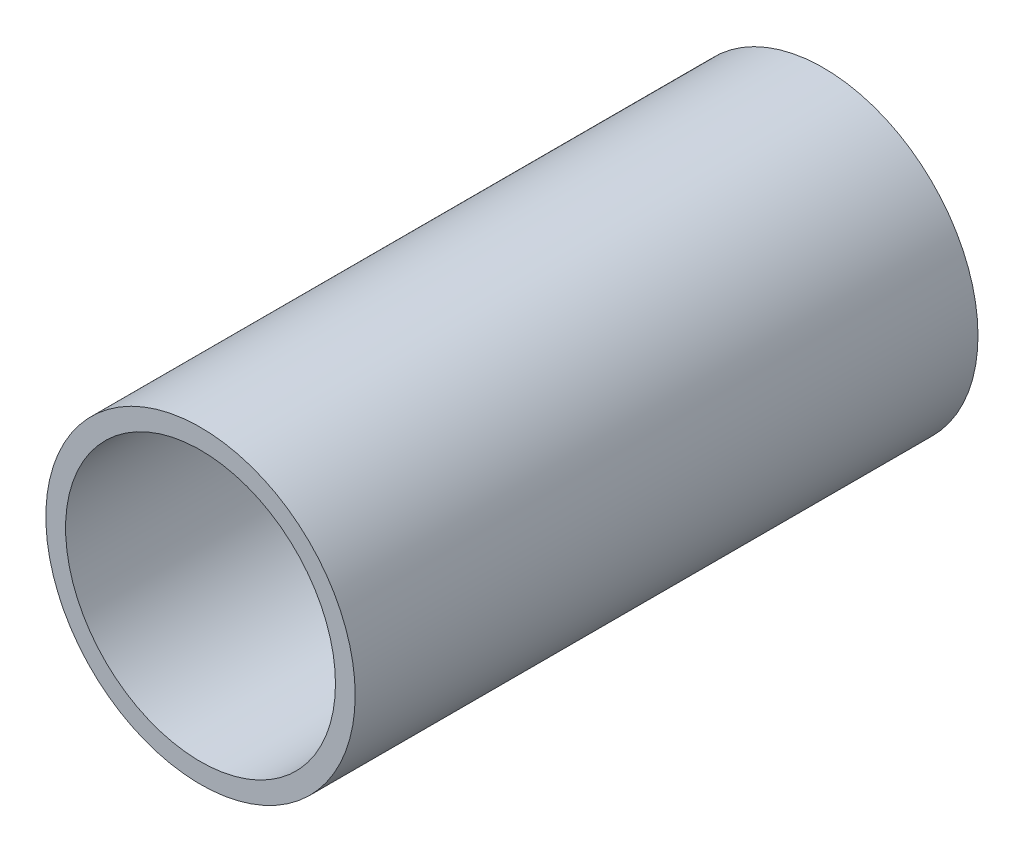
ISO-10303-21;
HEADER;
FILE_DESCRIPTION(('STEP AP214'),'2;1');
FILE_NAME('part.step','',(''),(''),'','','');
FILE_SCHEMA(('AUTOMOTIVE_DESIGN { 1 0 10303 214 1 1 1 1 }'));
ENDSEC;
DATA;
#1=APPLICATION_CONTEXT('core data for automotive mechanical design processes');
#2=APPLICATION_PROTOCOL_DEFINITION('international standard','automotive_design',2000,#1);
#3=PRODUCT_CONTEXT('',#1,'mechanical');
#4=PRODUCT('Part','Part','',(#3));
#5=PRODUCT_RELATED_PRODUCT_CATEGORY('part','',(#4));
#6=PRODUCT_DEFINITION_FORMATION('','',#4);
#7=PRODUCT_DEFINITION_CONTEXT('part definition',#1,'design');
#8=PRODUCT_DEFINITION('design','',#6,#7);
#9=PRODUCT_DEFINITION_SHAPE('','',#8);
#10=(LENGTH_UNIT() NAMED_UNIT(*) SI_UNIT(.MILLI.,.METRE.));
#11=(NAMED_UNIT(*) PLANE_ANGLE_UNIT() SI_UNIT($,.RADIAN.));
#12=(NAMED_UNIT(*) SI_UNIT($,.STERADIAN.) SOLID_ANGLE_UNIT());
#13=UNCERTAINTY_MEASURE_WITH_UNIT(LENGTH_MEASURE(1.E-05),#10,'distance_accuracy_value','');
#14=(GEOMETRIC_REPRESENTATION_CONTEXT(3) GLOBAL_UNCERTAINTY_ASSIGNED_CONTEXT((#13)) GLOBAL_UNIT_ASSIGNED_CONTEXT((#10,
#11,#12)) REPRESENTATION_CONTEXT('',''));
#15=CARTESIAN_POINT('',(0.,0.,0.));
#16=DIRECTION('',(0.,0.,1.));
#17=DIRECTION('',(1.,0.,0.));
#18=AXIS2_PLACEMENT_3D('',#15,#16,#17);
#19=CARTESIAN_POINT('',(0.,0.,76.2));
#20=DIRECTION('',(0.,0.,1.));
#21=DIRECTION('',(1.,0.,0.));
#22=AXIS2_PLACEMENT_3D('',#19,#20,#21);
#23=PLANE('',#22);
#24=CARTESIAN_POINT('',(0.,0.,76.2));
#25=DIRECTION('',(0.,0.,1.));
#26=DIRECTION('',(1.,0.,0.));
#27=AXIS2_PLACEMENT_3D('',#24,#25,#26);
#28=CIRCLE('',#27,18.923);
#29=CARTESIAN_POINT('',(18.923,0.,76.2));
#30=VERTEX_POINT('',#29);
#31=EDGE_CURVE('E10',#30,#30,#28,.T.);
#32=ORIENTED_EDGE('',*,*,#31,.T.);
#33=EDGE_LOOP('',(#32));
#34=FACE_BOUND('',#33,.T.);
#35=CARTESIAN_POINT('',(0.,0.,76.2));
#36=DIRECTION('',(0.,0.,1.));
#37=DIRECTION('',(1.,0.,0.));
#38=AXIS2_PLACEMENT_3D('',#35,#36,#37);
#39=CIRCLE('',#38,16.51);
#40=CARTESIAN_POINT('',(16.51,0.,76.2));
#41=VERTEX_POINT('',#40);
#42=EDGE_CURVE('E42',#41,#41,#39,.T.);
#43=ORIENTED_EDGE('',*,*,#42,.F.);
#44=EDGE_LOOP('',(#43));
#45=FACE_BOUND('',#44,.T.);
#46=ADVANCED_FACE('F31',(#34,#45),#23,.T.);
#47=CARTESIAN_POINT('',(0.,0.,0.));
#48=DIRECTION('',(0.,0.,1.));
#49=DIRECTION('',(1.,0.,0.));
#50=AXIS2_PLACEMENT_3D('',#47,#48,#49);
#51=PLANE('',#50);
#52=CARTESIAN_POINT('',(0.,0.,0.));
#53=DIRECTION('',(0.,0.,1.));
#54=DIRECTION('',(1.,0.,0.));
#55=AXIS2_PLACEMENT_3D('',#52,#53,#54);
#56=CIRCLE('',#55,18.923);
#57=CARTESIAN_POINT('',(18.923,0.,0.));
#58=VERTEX_POINT('',#57);
#59=EDGE_CURVE('E35',#58,#58,#56,.T.);
#60=ORIENTED_EDGE('',*,*,#59,.F.);
#61=EDGE_LOOP('',(#60));
#62=FACE_BOUND('',#61,.T.);
#63=CARTESIAN_POINT('',(0.,0.,0.));
#64=DIRECTION('',(0.,0.,1.));
#65=DIRECTION('',(1.,0.,0.));
#66=AXIS2_PLACEMENT_3D('',#63,#64,#65);
#67=CIRCLE('',#66,16.51);
#68=CARTESIAN_POINT('',(16.51,0.,0.));
#69=VERTEX_POINT('',#68);
#70=EDGE_CURVE('E44',#69,#69,#67,.T.);
#71=ORIENTED_EDGE('',*,*,#70,.T.);
#72=EDGE_LOOP('',(#71));
#73=FACE_BOUND('',#72,.T.);
#74=ADVANCED_FACE('F54',(#62,#73),#51,.F.);
#75=CARTESIAN_POINT('',(0.,0.,76.2));
#76=DIRECTION('',(0.,0.,-1.));
#77=DIRECTION('',(-1.,0.,0.));
#78=AXIS2_PLACEMENT_3D('',#75,#76,#77);
#79=CYLINDRICAL_SURFACE('',#78,18.923);
#80=ORIENTED_EDGE('',*,*,#31,.F.);
#81=EDGE_LOOP('',(#80));
#82=FACE_BOUND('',#81,.T.);
#83=ORIENTED_EDGE('',*,*,#59,.T.);
#84=EDGE_LOOP('',(#83));
#85=FACE_BOUND('',#84,.T.);
#86=ADVANCED_FACE('F33',(#82,#85),#79,.T.);
#87=CARTESIAN_POINT('',(0.,0.,76.2));
#88=DIRECTION('',(0.,0.,-1.));
#89=DIRECTION('',(-1.,0.,0.));
#90=AXIS2_PLACEMENT_3D('',#87,#88,#89);
#91=CYLINDRICAL_SURFACE('',#90,16.51);
#92=ORIENTED_EDGE('',*,*,#42,.T.);
#93=EDGE_LOOP('',(#92));
#94=FACE_BOUND('',#93,.T.);
#95=ORIENTED_EDGE('',*,*,#70,.F.);
#96=EDGE_LOOP('',(#95));
#97=FACE_BOUND('',#96,.T.);
#98=ADVANCED_FACE('F50',(#94,#97),#91,.F.);
#99=CLOSED_SHELL('',(#46,#74,#86,#98));
#100=MANIFOLD_SOLID_BREP('B2',#99);
#101=ADVANCED_BREP_SHAPE_REPRESENTATION('',(#18,#100),#14);
#102=SHAPE_DEFINITION_REPRESENTATION(#9,#101);
ENDSEC;
END-ISO-10303-21;
